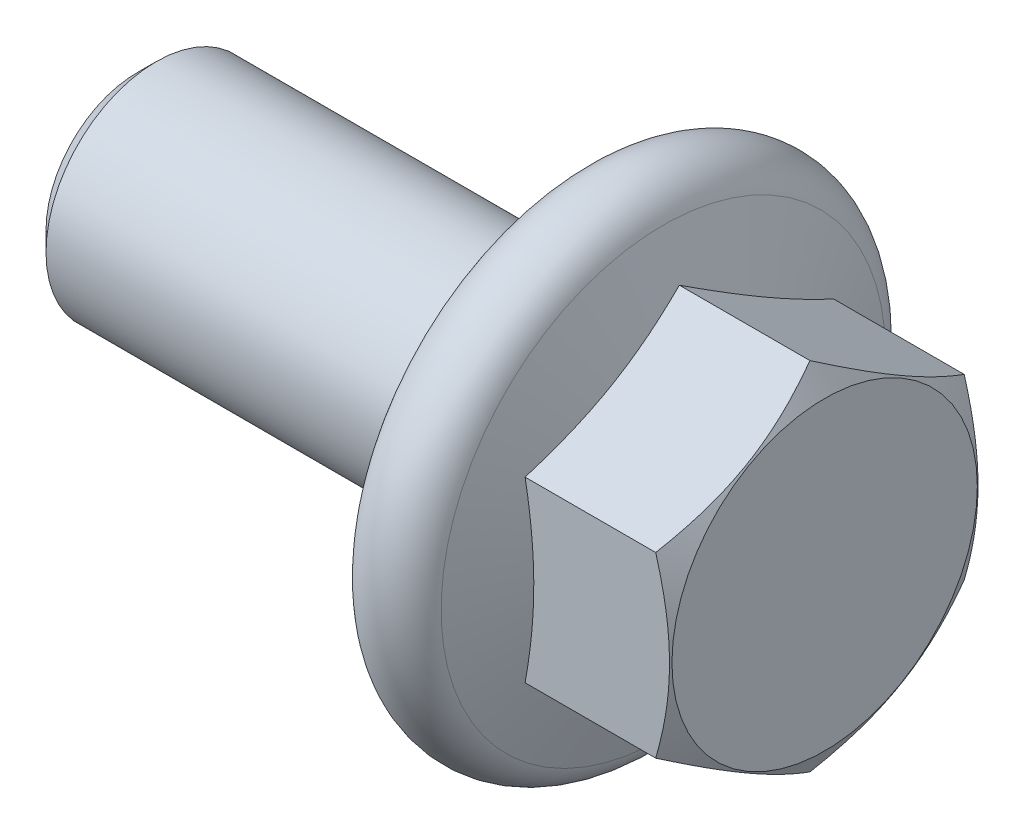
ISO-10303-21;
HEADER;
FILE_DESCRIPTION(('STEP AP214'),'2;1');
FILE_NAME('part.step','',(''),(''),'','','');
FILE_SCHEMA(('AUTOMOTIVE_DESIGN { 1 0 10303 214 1 1 1 1 }'));
ENDSEC;
DATA;
#1=APPLICATION_CONTEXT('core data for automotive mechanical design processes');
#2=APPLICATION_PROTOCOL_DEFINITION('international standard','automotive_design',2000,#1);
#3=PRODUCT_CONTEXT('',#1,'mechanical');
#4=PRODUCT('Part','Part','',(#3));
#5=PRODUCT_RELATED_PRODUCT_CATEGORY('part','',(#4));
#6=PRODUCT_DEFINITION_FORMATION('','',#4);
#7=PRODUCT_DEFINITION_CONTEXT('part definition',#1,'design');
#8=PRODUCT_DEFINITION('design','',#6,#7);
#9=PRODUCT_DEFINITION_SHAPE('','',#8);
#10=(LENGTH_UNIT() NAMED_UNIT(*) SI_UNIT(.MILLI.,.METRE.));
#11=(NAMED_UNIT(*) PLANE_ANGLE_UNIT() SI_UNIT($,.RADIAN.));
#12=(NAMED_UNIT(*) SI_UNIT($,.STERADIAN.) SOLID_ANGLE_UNIT());
#13=UNCERTAINTY_MEASURE_WITH_UNIT(LENGTH_MEASURE(1.E-05),#10,'distance_accuracy_value','');
#14=(GEOMETRIC_REPRESENTATION_CONTEXT(3) GLOBAL_UNCERTAINTY_ASSIGNED_CONTEXT((#13)) GLOBAL_UNIT_ASSIGNED_CONTEXT((#10,
#11,#12)) REPRESENTATION_CONTEXT('',''));
#15=CARTESIAN_POINT('',(0.,0.,0.));
#16=DIRECTION('',(0.,0.,1.));
#17=DIRECTION('',(1.,0.,0.));
#18=AXIS2_PLACEMENT_3D('',#15,#16,#17);
#19=CARTESIAN_POINT('',(286.686841982649,231.732577863432,-14.7960363538926));
#20=DIRECTION('',(0.,-0.866025403784439,0.5));
#21=DIRECTION('',(0.,0.5,0.866025403784439));
#22=AXIS2_PLACEMENT_3D('',#19,#20,#21);
#23=PLANE('',#22);
#24=CARTESIAN_POINT('',(285.690711667062,230.72221489235,-16.5460363538926));
#25=CARTESIAN_POINT('',(285.721179702552,230.805897608908,-16.4010936370985));
#26=CARTESIAN_POINT('',(285.748895550176,230.889856257758,-16.2556729915566));
#27=CARTESIAN_POINT('',(285.797657168736,231.058319411505,-15.9638862500622));
#28=CARTESIAN_POINT('',(285.818697721353,231.142824291017,-15.8175195052611));
#29=CARTESIAN_POINT('',(285.852730166642,231.311442187896,-15.5254647408003));
#30=CARTESIAN_POINT('',(285.865796282362,231.395551355216,-15.3797833896193));
#31=CARTESIAN_POINT('',(285.883321603825,231.563966359906,-15.0880800447394));
#32=CARTESIAN_POINT('',(285.887784036244,231.648272111669,-14.942058199316));
#33=CARTESIAN_POINT('',(285.887784036244,231.816883615195,-14.6500145084692));
#34=CARTESIAN_POINT('',(285.883321603825,231.901189366958,-14.5039926630458));
#35=CARTESIAN_POINT('',(285.865796282362,232.069604371647,-14.2122893181658));
#36=CARTESIAN_POINT('',(285.852730166642,232.153713538968,-14.0666079669849));
#37=CARTESIAN_POINT('',(285.818697721353,232.322331435847,-13.774553202524));
#38=CARTESIAN_POINT('',(285.797657168736,232.406836315359,-13.628186457723));
#39=CARTESIAN_POINT('',(285.748895550176,232.575299469106,-13.3363997162286));
#40=CARTESIAN_POINT('',(285.721179702552,232.659258117956,-13.1909790706867));
#41=CARTESIAN_POINT('',(285.690711667062,232.742940834514,-13.0460363538926));
#42=B_SPLINE_CURVE_WITH_KNOTS('',3,(#24,#25,#26,#27,#28,#29,#30,#31,#32,#33,#34,#35,#36,#37,#38,
#39,#40,#41),.UNSPECIFIED.,.F.,.F.,(4,2,2,2,2,2,2,2,4),(0.,0.510400948319181,1.02119991788174,
1.52716902069209,2.03294833077724,2.5387276408624,3.04469674367276,3.55549571323534,
4.06589666155451),.UNSPECIFIED.);
#43=CARTESIAN_POINT('',(285.690711667062,230.72221489235,-16.5460363538926));
#44=VERTEX_POINT('',#43);
#45=CARTESIAN_POINT('',(285.690711667062,232.742940834514,-13.0460363538926));
#46=VERTEX_POINT('',#45);
#47=EDGE_CURVE('E41',#44,#46,#42,.T.);
#48=ORIENTED_EDGE('',*,*,#47,.F.);
#49=DIRECTION('',(1.,0.,0.));
#50=VECTOR('',#49,1.);
#51=CARTESIAN_POINT('',(284.386841982649,230.72221489235,-16.5460363538926));
#52=LINE('',#51,#50);
#53=CARTESIAN_POINT('',(288.654027332057,230.72221489235,-16.5460363538925));
#54=VERTEX_POINT('',#53);
#55=EDGE_CURVE('E11',#44,#54,#52,.T.);
#56=ORIENTED_EDGE('',*,*,#55,.T.);
#57=CARTESIAN_POINT('',(288.654027332057,230.72221489235,-16.5460363538925));
#58=CARTESIAN_POINT('',(288.705310128086,230.81101355955,-16.3922325506572));
#59=CARTESIAN_POINT('',(288.751949147132,230.900578735583,-16.2371011151804));
#60=CARTESIAN_POINT('',(288.833356154107,231.081259848759,-15.9241522471918));
#61=CARTESIAN_POINT('',(288.868095346466,231.172378995211,-15.7663292559944));
#62=CARTESIAN_POINT('',(288.922169403902,231.35348809421,-15.4526390948144));
#63=CARTESIAN_POINT('',(288.941864203763,231.443450188607,-15.2968201765637));
#64=CARTESIAN_POINT('',(288.965371287829,231.623797457934,-14.9844495430839));
#65=CARTESIAN_POINT('',(288.969203042603,231.7141819778,-14.8278989624581));
#66=CARTESIAN_POINT('',(288.961211324287,231.883055756952,-14.5354009969003));
#67=CARTESIAN_POINT('',(288.951350082929,231.961570357124,-14.3994097202657));
#68=CARTESIAN_POINT('',(288.920102055801,232.11808806046,-14.1283131058041));
#69=CARTESIAN_POINT('',(288.898704606212,232.196090622674,-13.9932087049282));
#70=CARTESIAN_POINT('',(288.845215123715,232.35293076724,-13.7215536058745));
#71=CARTESIAN_POINT('',(288.812896458175,232.431748509368,-13.5850372719713));
#72=CARTESIAN_POINT('',(288.739546750589,232.588208767002,-13.3140401563839));
#73=CARTESIAN_POINT('',(288.698532931741,232.665853285398,-13.1795559055918));
#74=CARTESIAN_POINT('',(288.654027332057,232.742940834514,-13.0460363538926));
#75=B_SPLINE_CURVE_WITH_KNOTS('',3,(#57,#58,#59,#60,#61,#62,#63,#64,#65,#66,#67,#68,#69,#70,#71,
#72,#73,#74),.UNSPECIFIED.,.F.,.F.,(4,2,2,2,2,2,2,2,4),(0.,0.554778020224597,1.11088917979761,
1.65323831076784,2.1949215555715,2.66648861960608,3.13849233914043,3.62096283935531,
4.10248645365123),.UNSPECIFIED.);
#76=CARTESIAN_POINT('',(288.654027332057,232.742940834514,-13.0460363538926));
#77=VERTEX_POINT('',#76);
#78=EDGE_CURVE('E33',#54,#77,#75,.T.);
#79=ORIENTED_EDGE('',*,*,#78,.T.);
#80=DIRECTION('',(1.,0.,0.));
#81=VECTOR('',#80,1.);
#82=CARTESIAN_POINT('',(284.386841982649,232.742940834514,-13.0460363538926));
#83=LINE('',#82,#81);
#84=EDGE_CURVE('E148',#46,#77,#83,.T.);
#85=ORIENTED_EDGE('',*,*,#84,.F.);
#86=EDGE_LOOP('',(#48,#56,#79,#85));
#87=FACE_BOUND('',#86,.T.);
#88=ADVANCED_FACE('F17',(#87),#23,.T.);
#89=CARTESIAN_POINT('',(286.686841982649,234.763666776678,-13.0460363538926));
#90=DIRECTION('',(0.,0.,1.));
#91=DIRECTION('',(0.,1.,0.));
#92=AXIS2_PLACEMENT_3D('',#89,#90,#91);
#93=PLANE('',#92);
#94=CARTESIAN_POINT('',(285.690711667062,232.742940834514,-13.0460363538926));
#95=CARTESIAN_POINT('',(285.721179702552,232.91030626763,-13.0460363538926));
#96=CARTESIAN_POINT('',(285.748895550176,233.078223565329,-13.0460363538926));
#97=CARTESIAN_POINT('',(285.797657168736,233.415149872825,-13.0460363538926));
#98=CARTESIAN_POINT('',(285.818697721354,233.584159631847,-13.0460363538926));
#99=CARTESIAN_POINT('',(285.852730166642,233.921395425607,-13.0460363538926));
#100=CARTESIAN_POINT('',(285.865796282362,234.089613760247,-13.0460363538926));
#101=CARTESIAN_POINT('',(285.883321603825,234.426443769627,-13.0460363538926));
#102=CARTESIAN_POINT('',(285.887784036244,234.595055273152,-13.0460363538926));
#103=CARTESIAN_POINT('',(285.887784036244,234.932278280204,-13.0460363538926));
#104=CARTESIAN_POINT('',(285.883321603825,235.100889783729,-13.0460363538926));
#105=CARTESIAN_POINT('',(285.865796282362,235.437719793109,-13.0460363538926));
#106=CARTESIAN_POINT('',(285.852730166642,235.605938127749,-13.0460363538926));
#107=CARTESIAN_POINT('',(285.818697721354,235.943173921509,-13.0460363538926));
#108=CARTESIAN_POINT('',(285.797657168736,236.112183680531,-13.0460363538926));
#109=CARTESIAN_POINT('',(285.748895550176,236.449109988027,-13.0460363538926));
#110=CARTESIAN_POINT('',(285.721179702552,236.617027285726,-13.0460363538926));
#111=CARTESIAN_POINT('',(285.690711667062,236.784392718842,-13.0460363538926));
#112=B_SPLINE_CURVE_WITH_KNOTS('',3,(#94,#95,#96,#97,#98,#99,#100,#101,#102,#103,#104,#105,#106,
#107,#108,#109,#110,#111),.UNSPECIFIED.,.F.,.F.,(4,2,2,2,2,2,2,2,4),(0.,0.510400948319247,
1.02119991788187,1.52716902069227,2.03294833077751,2.53872764086272,3.04469674367309,
3.55549571323574,4.06589666155499),.UNSPECIFIED.);
#113=CARTESIAN_POINT('',(285.690711667062,236.784392718842,-13.0460363538926));
#114=VERTEX_POINT('',#113);
#115=EDGE_CURVE('E255',#46,#114,#112,.T.);
#116=ORIENTED_EDGE('',*,*,#115,.F.);
#117=ORIENTED_EDGE('',*,*,#84,.T.);
#118=CARTESIAN_POINT('',(288.654027332057,232.742940834514,-13.0460363538926));
#119=CARTESIAN_POINT('',(288.705310128086,232.920538168915,-13.0460363538926));
#120=CARTESIAN_POINT('',(288.751949147132,233.099668520979,-13.0460363538926));
#121=CARTESIAN_POINT('',(288.833356154107,233.461030747331,-13.0460363538926));
#122=CARTESIAN_POINT('',(288.868095346466,233.643269040235,-13.0460363538926));
#123=CARTESIAN_POINT('',(288.922169403902,234.005487238234,-13.0460363538926));
#124=CARTESIAN_POINT('',(288.941864203763,234.185411427028,-13.0460363538926));
#125=CARTESIAN_POINT('',(288.965371287829,234.546105965681,-13.0460363538926));
#126=CARTESIAN_POINT('',(288.969203042603,234.726875005413,-13.0460363538926));
#127=CARTESIAN_POINT('',(288.961211324287,235.064622563717,-13.0460363538926));
#128=CARTESIAN_POINT('',(288.951350082929,235.221651764062,-13.0460363538926));
#129=CARTESIAN_POINT('',(288.920102055801,235.534687170734,-13.0460363538926));
#130=CARTESIAN_POINT('',(288.898704606212,235.690692295163,-13.0460363538926));
#131=CARTESIAN_POINT('',(288.845215123716,236.004372584294,-13.0460363538926));
#132=CARTESIAN_POINT('',(288.812896458176,236.162008068549,-13.0460363538926));
#133=CARTESIAN_POINT('',(288.739546750589,236.474928583817,-13.0460363538926));
#134=CARTESIAN_POINT('',(288.698532931741,236.630217620611,-13.0460363538926));
#135=CARTESIAN_POINT('',(288.654027332057,236.784392718842,-13.0460363538926));
#136=B_SPLINE_CURVE_WITH_KNOTS('',3,(#118,#119,#120,#121,#122,#123,#124,#125,#126,#127,#128,
#129,#130,#131,#132,#133,#134,#135),.UNSPECIFIED.,.F.,.F.,(4,2,2,2,2,2,2,2,4),(0.,
0.554778020224548,1.11088917979758,1.65323831076777,2.19492155557137,2.66648861960611,
3.13849233914063,3.62096283935574,4.10248645365189),.UNSPECIFIED.);
#137=CARTESIAN_POINT('',(288.654027332057,236.784392718842,-13.0460363538926));
#138=VERTEX_POINT('',#137);
#139=EDGE_CURVE('E150',#77,#138,#136,.T.);
#140=ORIENTED_EDGE('',*,*,#139,.T.);
#141=DIRECTION('',(1.,0.,0.));
#142=VECTOR('',#141,1.);
#143=CARTESIAN_POINT('',(284.386841982649,236.784392718842,-13.0460363538926));
#144=LINE('',#143,#142);
#145=EDGE_CURVE('E159',#114,#138,#144,.T.);
#146=ORIENTED_EDGE('',*,*,#145,.F.);
#147=EDGE_LOOP('',(#116,#117,#140,#146));
#148=FACE_BOUND('',#147,.T.);
#149=ADVANCED_FACE('F260',(#148),#93,.T.);
#150=CARTESIAN_POINT('',(286.686841982649,237.794755689923,-14.7960363538926));
#151=DIRECTION('',(0.,0.866025403784439,0.5));
#152=DIRECTION('',(0.,0.5,-0.866025403784439));
#153=AXIS2_PLACEMENT_3D('',#150,#151,#152);
#154=PLANE('',#153);
#155=CARTESIAN_POINT('',(285.690711667062,236.784392718842,-13.046036353893));
#156=CARTESIAN_POINT('',(285.721179702552,236.8680754354,-13.1909790706871));
#157=CARTESIAN_POINT('',(285.748895550176,236.952034084249,-13.336399716229));
#158=CARTESIAN_POINT('',(285.797657168736,237.120497237997,-13.6281864577234));
#159=CARTESIAN_POINT('',(285.818697721354,237.205002117508,-13.7745532025244));
#160=CARTESIAN_POINT('',(285.852730166643,237.373620014388,-14.0666079669853));
#161=CARTESIAN_POINT('',(285.865796282363,237.457729181708,-14.2122893181662));
#162=CARTESIAN_POINT('',(285.883321603825,237.626144186398,-14.5039926630461));
#163=CARTESIAN_POINT('',(285.887784036245,237.71044993816,-14.6500145084695));
#164=CARTESIAN_POINT('',(285.887784036245,237.879061441686,-14.9420581993163));
#165=CARTESIAN_POINT('',(285.883321603825,237.963367193449,-15.0880800447396));
#166=CARTESIAN_POINT('',(285.865796282363,238.131782198139,-15.3797833896196));
#167=CARTESIAN_POINT('',(285.852730166643,238.215891365459,-15.5254647408005));
#168=CARTESIAN_POINT('',(285.818697721354,238.384509262338,-15.8175195052613));
#169=CARTESIAN_POINT('',(285.797657168736,238.46901414185,-15.9638862500624));
#170=CARTESIAN_POINT('',(285.748895550176,238.637477295597,-16.2556729915567));
#171=CARTESIAN_POINT('',(285.721179702552,238.721435944447,-16.4010936370986));
#172=CARTESIAN_POINT('',(285.690711667062,238.805118661005,-16.5460363538927));
#173=B_SPLINE_CURVE_WITH_KNOTS('',3,(#155,#156,#157,#158,#159,#160,#161,#162,#163,#164,#165,
#166,#167,#168,#169,#170,#171,#172),.UNSPECIFIED.,.F.,.F.,(4,2,2,2,2,2,2,2,4),(0.,
0.510400948319119,1.02119991788166,1.52716902069197,2.03294833077706,2.53872764086216,
3.04469674367245,3.555495713235,4.06589666155412),.UNSPECIFIED.);
#174=CARTESIAN_POINT('',(285.690711667062,238.805118661005,-16.5460363538927));
#175=VERTEX_POINT('',#174);
#176=EDGE_CURVE('E228',#114,#175,#173,.T.);
#177=ORIENTED_EDGE('',*,*,#176,.F.);
#178=ORIENTED_EDGE('',*,*,#145,.T.);
#179=CARTESIAN_POINT('',(288.654027332058,236.784392718842,-13.046036353893));
#180=CARTESIAN_POINT('',(288.705310128086,236.873191386042,-13.1998401571283));
#181=CARTESIAN_POINT('',(288.751949147133,236.962756562074,-13.3549715926051));
#182=CARTESIAN_POINT('',(288.833356154107,237.14343767525,-13.6679204605936));
#183=CARTESIAN_POINT('',(288.868095346466,237.234556821702,-13.825743451791));
#184=CARTESIAN_POINT('',(288.922169403902,237.415665920701,-14.1394336129709));
#185=CARTESIAN_POINT('',(288.941864203763,237.505628015098,-14.2952525312216));
#186=CARTESIAN_POINT('',(288.96537128783,237.685975284425,-14.6076231647013));
#187=CARTESIAN_POINT('',(288.969203042603,237.776359804291,-14.764173745327));
#188=CARTESIAN_POINT('',(288.961211324287,237.945233583443,-15.0566717108848));
#189=CARTESIAN_POINT('',(288.951350082929,238.023748183615,-15.1926629875194));
#190=CARTESIAN_POINT('',(288.920102055801,238.180265886951,-15.463759601981));
#191=CARTESIAN_POINT('',(288.898704606213,238.258268449165,-15.5988640028569));
#192=CARTESIAN_POINT('',(288.845215123716,238.415108593731,-15.8705191019107));
#193=CARTESIAN_POINT('',(288.812896458176,238.493926335859,-16.0070354358139));
#194=CARTESIAN_POINT('',(288.739546750589,238.650386593493,-16.2780325514013));
#195=CARTESIAN_POINT('',(288.698532931742,238.728031111889,-16.4125168021935));
#196=CARTESIAN_POINT('',(288.654027332058,238.805118661005,-16.5460363538927));
#197=B_SPLINE_CURVE_WITH_KNOTS('',3,(#179,#180,#181,#182,#183,#184,#185,#186,#187,#188,#189,
#190,#191,#192,#193,#194,#195,#196),.UNSPECIFIED.,.F.,.F.,(4,2,2,2,2,2,2,2,4),(0.,
0.554778020224428,1.11088917979728,1.65323831076738,2.19492155557089,2.6664886196055,
3.13849233913986,3.62096283935479,4.10248645365079),.UNSPECIFIED.);
#198=CARTESIAN_POINT('',(288.654027332058,238.805118661005,-16.5460363538927));
#199=VERTEX_POINT('',#198);
#200=EDGE_CURVE('E158',#138,#199,#197,.T.);
#201=ORIENTED_EDGE('',*,*,#200,.T.);
#202=DIRECTION('',(1.,0.,0.));
#203=VECTOR('',#202,1.);
#204=CARTESIAN_POINT('',(284.386841982649,238.805118661005,-16.5460363538926));
#205=LINE('',#204,#203);
#206=EDGE_CURVE('E156',#175,#199,#205,.T.);
#207=ORIENTED_EDGE('',*,*,#206,.F.);
#208=EDGE_LOOP('',(#177,#178,#201,#207));
#209=FACE_BOUND('',#208,.T.);
#210=ADVANCED_FACE('F219',(#209),#154,.T.);
#211=CARTESIAN_POINT('',(286.686841982649,237.794755689923,-18.2960363538926));
#212=DIRECTION('',(0.,0.866025403784439,-0.5));
#213=DIRECTION('',(0.,-0.5,-0.866025403784439));
#214=AXIS2_PLACEMENT_3D('',#211,#212,#213);
#215=PLANE('',#214);
#216=CARTESIAN_POINT('',(285.690711667062,238.805118661005,-16.5460363538925));
#217=CARTESIAN_POINT('',(285.721179702552,238.721435944447,-16.6909790706866));
#218=CARTESIAN_POINT('',(285.748895550176,238.637477295597,-16.8363997162285));
#219=CARTESIAN_POINT('',(285.797657168736,238.46901414185,-17.1281864577228));
#220=CARTESIAN_POINT('',(285.818697721354,238.384509262338,-17.2745532025239));
#221=CARTESIAN_POINT('',(285.852730166643,238.215891365459,-17.5666079669847));
#222=CARTESIAN_POINT('',(285.865796282363,238.131782198139,-17.7122893181656));
#223=CARTESIAN_POINT('',(285.883321603825,237.963367193449,-18.0039926630456));
#224=CARTESIAN_POINT('',(285.887784036245,237.879061441686,-18.1500145084689));
#225=CARTESIAN_POINT('',(285.887784036245,237.71044993816,-18.4420581993157));
#226=CARTESIAN_POINT('',(285.883321603825,237.626144186398,-18.5880800447391));
#227=CARTESIAN_POINT('',(285.865796282363,237.457729181708,-18.879783389619));
#228=CARTESIAN_POINT('',(285.852730166643,237.373620014388,-19.0254647407999));
#229=CARTESIAN_POINT('',(285.818697721354,237.205002117508,-19.3175195052608));
#230=CARTESIAN_POINT('',(285.797657168736,237.120497237997,-19.4638862500618));
#231=CARTESIAN_POINT('',(285.748895550176,236.952034084249,-19.7556729915562));
#232=CARTESIAN_POINT('',(285.721179702552,236.8680754354,-19.9010936370981));
#233=CARTESIAN_POINT('',(285.690711667062,236.784392718842,-20.0460363538923));
#234=B_SPLINE_CURVE_WITH_KNOTS('',3,(#216,#217,#218,#219,#220,#221,#222,#223,#224,#225,#226,
#227,#228,#229,#230,#231,#232,#233),.UNSPECIFIED.,.F.,.F.,(4,2,2,2,2,2,2,2,4),(0.,
0.51040094831914,1.02119991788167,1.52716902069196,2.03294833077706,2.53872764086216,
3.04469674367247,3.555495713235,4.06589666155413),.UNSPECIFIED.);
#235=CARTESIAN_POINT('',(285.690711667062,236.784392718842,-20.0460363538924));
#236=VERTEX_POINT('',#235);
#237=EDGE_CURVE('E64',#175,#236,#234,.T.);
#238=ORIENTED_EDGE('',*,*,#237,.F.);
#239=ORIENTED_EDGE('',*,*,#206,.T.);
#240=CARTESIAN_POINT('',(288.654027332058,238.805118661005,-16.5460363538925));
#241=CARTESIAN_POINT('',(288.705310128086,238.716319993805,-16.6998401571278));
#242=CARTESIAN_POINT('',(288.751949147133,238.626754817772,-16.8549715926046));
#243=CARTESIAN_POINT('',(288.833356154107,238.446073704597,-17.1679204605931));
#244=CARTESIAN_POINT('',(288.868095346466,238.354954558144,-17.3257434517905));
#245=CARTESIAN_POINT('',(288.922169403902,238.173845459145,-17.6394336129704));
#246=CARTESIAN_POINT('',(288.941864203763,238.083883364748,-17.795252531221));
#247=CARTESIAN_POINT('',(288.96537128783,237.903536095422,-18.1076231647008));
#248=CARTESIAN_POINT('',(288.969203042603,237.813151575556,-18.2641737453266));
#249=CARTESIAN_POINT('',(288.961211324287,237.644277796404,-18.5566717108843));
#250=CARTESIAN_POINT('',(288.951350082929,237.565763196231,-18.6926629875189));
#251=CARTESIAN_POINT('',(288.920102055801,237.409245492895,-18.9637596019804));
#252=CARTESIAN_POINT('',(288.898704606213,237.331242930681,-19.0988640028564));
#253=CARTESIAN_POINT('',(288.845215123716,237.174402786115,-19.3705191019101));
#254=CARTESIAN_POINT('',(288.812896458176,237.095585043988,-19.5070354358134));
#255=CARTESIAN_POINT('',(288.739546750589,236.939124786354,-19.7780325514007));
#256=CARTESIAN_POINT('',(288.698532931742,236.861480267957,-19.9125168021929));
#257=CARTESIAN_POINT('',(288.654027332058,236.784392718842,-20.0460363538922));
#258=B_SPLINE_CURVE_WITH_KNOTS('',3,(#240,#241,#242,#243,#244,#245,#246,#247,#248,#249,#250,
#251,#252,#253,#254,#255,#256,#257),.UNSPECIFIED.,.F.,.F.,(4,2,2,2,2,2,2,2,4),(0.,
0.554778020224401,1.11088917979728,1.65323831076737,2.19492155557089,2.6664886196055,
3.13849233913987,3.6209628393548,4.10248645365077),.UNSPECIFIED.);
#259=CARTESIAN_POINT('',(288.654027332058,236.784392718842,-20.0460363538924));
#260=VERTEX_POINT('',#259);
#261=EDGE_CURVE('E155',#199,#260,#258,.T.);
#262=ORIENTED_EDGE('',*,*,#261,.T.);
#263=DIRECTION('',(1.,0.,0.));
#264=VECTOR('',#263,1.);
#265=CARTESIAN_POINT('',(284.386841982649,236.784392718842,-20.0460363538926));
#266=LINE('',#265,#264);
#267=EDGE_CURVE('E153',#236,#260,#266,.T.);
#268=ORIENTED_EDGE('',*,*,#267,.F.);
#269=EDGE_LOOP('',(#238,#239,#262,#268));
#270=FACE_BOUND('',#269,.T.);
#271=ADVANCED_FACE('F214',(#270),#215,.T.);
#272=CARTESIAN_POINT('',(286.686841982649,234.763666776678,-20.0460363538926));
#273=DIRECTION('',(0.,0.,-1.));
#274=DIRECTION('',(0.,-1.,0.));
#275=AXIS2_PLACEMENT_3D('',#272,#273,#274);
#276=PLANE('',#275);
#277=CARTESIAN_POINT('',(285.690711667062,236.784392718842,-20.0460363538926));
#278=CARTESIAN_POINT('',(285.721179702552,236.617027285726,-20.0460363538926));
#279=CARTESIAN_POINT('',(285.748895550176,236.449109988027,-20.0460363538926));
#280=CARTESIAN_POINT('',(285.797657168736,236.112183680531,-20.0460363538926));
#281=CARTESIAN_POINT('',(285.818697721354,235.943173921509,-20.0460363538926));
#282=CARTESIAN_POINT('',(285.852730166642,235.605938127749,-20.0460363538926));
#283=CARTESIAN_POINT('',(285.865796282362,235.437719793109,-20.0460363538926));
#284=CARTESIAN_POINT('',(285.883321603825,235.100889783729,-20.0460363538926));
#285=CARTESIAN_POINT('',(285.887784036244,234.932278280204,-20.0460363538926));
#286=CARTESIAN_POINT('',(285.887784036244,234.595055273152,-20.0460363538926));
#287=CARTESIAN_POINT('',(285.883321603825,234.426443769627,-20.0460363538926));
#288=CARTESIAN_POINT('',(285.865796282362,234.089613760247,-20.0460363538926));
#289=CARTESIAN_POINT('',(285.852730166642,233.921395425607,-20.0460363538926));
#290=CARTESIAN_POINT('',(285.818697721354,233.584159631847,-20.0460363538926));
#291=CARTESIAN_POINT('',(285.797657168736,233.415149872825,-20.0460363538926));
#292=CARTESIAN_POINT('',(285.748895550176,233.078223565329,-20.0460363538926));
#293=CARTESIAN_POINT('',(285.721179702552,232.91030626763,-20.0460363538926));
#294=CARTESIAN_POINT('',(285.690711667062,232.742940834514,-20.0460363538926));
#295=B_SPLINE_CURVE_WITH_KNOTS('',3,(#277,#278,#279,#280,#281,#282,#283,#284,#285,#286,#287,
#288,#289,#290,#291,#292,#293,#294),.UNSPECIFIED.,.F.,.F.,(4,2,2,2,2,2,2,2,4),(0.,
0.510400948319247,1.0211999178819,1.52716902069227,2.03294833077748,2.53872764086272,
3.04469674367312,3.55549571323574,4.06589666155499),.UNSPECIFIED.);
#296=CARTESIAN_POINT('',(285.690711667062,232.742940834514,-20.0460363538926));
#297=VERTEX_POINT('',#296);
#298=EDGE_CURVE('E21',#236,#297,#295,.T.);
#299=ORIENTED_EDGE('',*,*,#298,.F.);
#300=ORIENTED_EDGE('',*,*,#267,.T.);
#301=CARTESIAN_POINT('',(288.654027332057,236.784392718842,-20.0460363538926));
#302=CARTESIAN_POINT('',(288.705310128086,236.606795384441,-20.0460363538926));
#303=CARTESIAN_POINT('',(288.751949147132,236.427665032377,-20.0460363538926));
#304=CARTESIAN_POINT('',(288.833356154107,236.066302806025,-20.0460363538926));
#305=CARTESIAN_POINT('',(288.868095346466,235.884064513121,-20.0460363538926));
#306=CARTESIAN_POINT('',(288.922169403902,235.521846315122,-20.0460363538926));
#307=CARTESIAN_POINT('',(288.941864203763,235.341922126328,-20.0460363538926));
#308=CARTESIAN_POINT('',(288.965371287829,234.981227587675,-20.0460363538926));
#309=CARTESIAN_POINT('',(288.969203042603,234.800458547943,-20.0460363538926));
#310=CARTESIAN_POINT('',(288.961211324287,234.462710989639,-20.0460363538926));
#311=CARTESIAN_POINT('',(288.951350082929,234.305681789294,-20.0460363538926));
#312=CARTESIAN_POINT('',(288.920102055801,233.992646382622,-20.0460363538926));
#313=CARTESIAN_POINT('',(288.898704606212,233.836641258193,-20.0460363538926));
#314=CARTESIAN_POINT('',(288.845215123716,233.522960969062,-20.0460363538926));
#315=CARTESIAN_POINT('',(288.812896458176,233.365325484807,-20.0460363538926));
#316=CARTESIAN_POINT('',(288.739546750589,233.052404969539,-20.0460363538926));
#317=CARTESIAN_POINT('',(288.698532931741,232.897115932745,-20.0460363538926));
#318=CARTESIAN_POINT('',(288.654027332057,232.742940834514,-20.0460363538926));
#319=B_SPLINE_CURVE_WITH_KNOTS('',3,(#301,#302,#303,#304,#305,#306,#307,#308,#309,#310,#311,
#312,#313,#314,#315,#316,#317,#318),.UNSPECIFIED.,.F.,.F.,(4,2,2,2,2,2,2,2,4),(0.,
0.554778020224548,1.11088917979761,1.65323831076782,2.19492155557142,2.66648861960614,
3.13849233914066,3.62096283935576,4.10248645365189),.UNSPECIFIED.);
#320=CARTESIAN_POINT('',(288.654027332057,232.742940834514,-20.0460363538926));
#321=VERTEX_POINT('',#320);
#322=EDGE_CURVE('E152',#260,#321,#319,.T.);
#323=ORIENTED_EDGE('',*,*,#322,.T.);
#324=DIRECTION('',(1.,0.,0.));
#325=VECTOR('',#324,1.);
#326=CARTESIAN_POINT('',(284.386841982649,232.742940834514,-20.0460363538926));
#327=LINE('',#326,#325);
#328=EDGE_CURVE('E73',#297,#321,#327,.T.);
#329=ORIENTED_EDGE('',*,*,#328,.F.);
#330=EDGE_LOOP('',(#299,#300,#323,#329));
#331=FACE_BOUND('',#330,.T.);
#332=ADVANCED_FACE('F211',(#331),#276,.T.);
#333=CARTESIAN_POINT('',(286.686841982649,231.732577863432,-18.2960363538926));
#334=DIRECTION('',(0.,-0.866025403784439,-0.5));
#335=DIRECTION('',(0.,-0.5,0.866025403784439));
#336=AXIS2_PLACEMENT_3D('',#333,#334,#335);
#337=PLANE('',#336);
#338=CARTESIAN_POINT('',(285.690711667062,232.742940834514,-20.0460363538926));
#339=CARTESIAN_POINT('',(285.721179702552,232.659258117956,-19.9010936370985));
#340=CARTESIAN_POINT('',(285.748895550176,232.575299469106,-19.7556729915566));
#341=CARTESIAN_POINT('',(285.797657168736,232.406836315359,-19.4638862500622));
#342=CARTESIAN_POINT('',(285.818697721353,232.322331435847,-19.3175195052612));
#343=CARTESIAN_POINT('',(285.852730166642,232.153713538968,-19.0254647408003));
#344=CARTESIAN_POINT('',(285.865796282362,232.069604371647,-18.8797833896194));
#345=CARTESIAN_POINT('',(285.883321603825,231.901189366958,-18.5880800447394));
#346=CARTESIAN_POINT('',(285.887784036244,231.816883615195,-18.442058199316));
#347=CARTESIAN_POINT('',(285.887784036244,231.648272111669,-18.1500145084692));
#348=CARTESIAN_POINT('',(285.883321603825,231.563966359906,-18.0039926630458));
#349=CARTESIAN_POINT('',(285.865796282362,231.395551355216,-17.7122893181658));
#350=CARTESIAN_POINT('',(285.852730166642,231.311442187896,-17.5666079669849));
#351=CARTESIAN_POINT('',(285.818697721353,231.142824291017,-17.274553202524));
#352=CARTESIAN_POINT('',(285.797657168736,231.058319411505,-17.128186457723));
#353=CARTESIAN_POINT('',(285.748895550176,230.889856257758,-16.8363997162286));
#354=CARTESIAN_POINT('',(285.721179702552,230.805897608908,-16.6909790706867));
#355=CARTESIAN_POINT('',(285.690711667062,230.72221489235,-16.5460363538925));
#356=B_SPLINE_CURVE_WITH_KNOTS('',3,(#338,#339,#340,#341,#342,#343,#344,#345,#346,#347,#348,
#349,#350,#351,#352,#353,#354,#355),.UNSPECIFIED.,.F.,.F.,(4,2,2,2,2,2,2,2,4),(0.,
0.510400948319185,1.02119991788176,1.52716902069212,2.03294833077728,2.53872764086243,
3.04469674367279,3.55549571323535,4.06589666155454),.UNSPECIFIED.);
#357=EDGE_CURVE('E121',#297,#44,#356,.T.);
#358=ORIENTED_EDGE('',*,*,#357,.F.);
#359=ORIENTED_EDGE('',*,*,#328,.T.);
#360=CARTESIAN_POINT('',(288.654027332057,232.742940834514,-20.0460363538925));
#361=CARTESIAN_POINT('',(288.705310128086,232.654142167314,-19.8922325506573));
#362=CARTESIAN_POINT('',(288.751949147132,232.564576991281,-19.7371011151805));
#363=CARTESIAN_POINT('',(288.833356154107,232.383895878105,-19.4241522471919));
#364=CARTESIAN_POINT('',(288.868095346466,232.292776731653,-19.2663292559945));
#365=CARTESIAN_POINT('',(288.922169403902,232.111667632654,-18.9526390948145));
#366=CARTESIAN_POINT('',(288.941864203763,232.021705538257,-18.7968201765637));
#367=CARTESIAN_POINT('',(288.965371287829,231.84135826893,-18.484449543084));
#368=CARTESIAN_POINT('',(288.969203042603,231.750973749064,-18.3278989624582));
#369=CARTESIAN_POINT('',(288.961211324287,231.582099969912,-18.0354009969004));
#370=CARTESIAN_POINT('',(288.951350082929,231.50358536974,-17.8994097202658));
#371=CARTESIAN_POINT('',(288.920102055801,231.347067666404,-17.6283131058042));
#372=CARTESIAN_POINT('',(288.898704606212,231.26906510419,-17.4932087049283));
#373=CARTESIAN_POINT('',(288.845215123715,231.112224959624,-17.2215536058746));
#374=CARTESIAN_POINT('',(288.812896458175,231.033407217496,-17.0850372719713));
#375=CARTESIAN_POINT('',(288.739546750589,230.876946959862,-16.814040156384));
#376=CARTESIAN_POINT('',(288.698532931741,230.799302441466,-16.6795559055918));
#377=CARTESIAN_POINT('',(288.654027332057,230.72221489235,-16.5460363538927));
#378=B_SPLINE_CURVE_WITH_KNOTS('',3,(#360,#361,#362,#363,#364,#365,#366,#367,#368,#369,#370,
#371,#372,#373,#374,#375,#376,#377),.UNSPECIFIED.,.F.,.F.,(4,2,2,2,2,2,2,2,4),(0.,
0.554778020224549,1.11088917979756,1.65323831076781,2.19492155557145,2.66648861960601,
3.13849233914037,3.62096283935529,4.10248645365123),.UNSPECIFIED.);
#379=EDGE_CURVE('E116',#321,#54,#378,.T.);
#380=ORIENTED_EDGE('',*,*,#379,.T.);
#381=ORIENTED_EDGE('',*,*,#55,.F.);
#382=EDGE_LOOP('',(#358,#359,#380,#381));
#383=FACE_BOUND('',#382,.T.);
#384=ADVANCED_FACE('F181',(#383),#337,.T.);
#385=CARTESIAN_POINT('',(290.987360665391,234.763666776678,-16.5460363538926));
#386=DIRECTION('',(-1.,0.,0.));
#387=DIRECTION('',(0.,0.,-1.));
#388=AXIS2_PLACEMENT_3D('',#385,#386,#387);
#389=CONICAL_SURFACE('',#388,0.,1.0471975511966);
#390=ORIENTED_EDGE('',*,*,#78,.F.);
#391=ORIENTED_EDGE('',*,*,#379,.F.);
#392=ORIENTED_EDGE('',*,*,#322,.F.);
#393=ORIENTED_EDGE('',*,*,#261,.F.);
#394=ORIENTED_EDGE('',*,*,#200,.F.);
#395=ORIENTED_EDGE('',*,*,#139,.F.);
#396=EDGE_LOOP('',(#390,#391,#392,#393,#394,#395));
#397=FACE_BOUND('',#396,.T.);
#398=CARTESIAN_POINT('',(288.986841982649,234.763666776678,-16.5460363538926));
#399=DIRECTION('',(1.,0.,0.));
#400=DIRECTION('',(0.,0.,-1.));
#401=AXIS2_PLACEMENT_3D('',#398,#399,#400);
#402=CIRCLE('',#401,3.465);
#403=CARTESIAN_POINT('',(288.986841982649,234.763666776678,-20.0110363538926));
#404=VERTEX_POINT('',#403);
#405=EDGE_CURVE('E113',#404,#404,#402,.T.);
#406=ORIENTED_EDGE('',*,*,#405,.F.);
#407=EDGE_LOOP('',(#406));
#408=FACE_BOUND('',#407,.T.);
#409=ADVANCED_FACE('F114',(#397,#408),#389,.T.);
#410=CARTESIAN_POINT('',(288.986841982649,234.763666776678,-16.5460363538926));
#411=DIRECTION('',(1.,0.,0.));
#412=DIRECTION('',(0.,0.,1.));
#413=AXIS2_PLACEMENT_3D('',#410,#411,#412);
#414=PLANE('',#413);
#415=ORIENTED_EDGE('',*,*,#405,.T.);
#416=EDGE_LOOP('',(#415));
#417=FACE_BOUND('',#416,.T.);
#418=ADVANCED_FACE('F180',(#417),#414,.T.);
#419=CARTESIAN_POINT('',(283.386841982649,234.763666776678,-16.5460363538926));
#420=DIRECTION('',(-1.,0.,0.));
#421=DIRECTION('',(0.,0.,-1.));
#422=AXIS2_PLACEMENT_3D('',#419,#420,#421);
#423=PLANE('',#422);
#424=CARTESIAN_POINT('',(283.386841982649,234.763666776678,-16.5460363538926));
#425=DIRECTION('',(-1.,0.,0.));
#426=DIRECTION('',(0.,0.,1.));
#427=AXIS2_PLACEMENT_3D('',#424,#425,#426);
#428=CIRCLE('',#427,3.05551918177834);
#429=CARTESIAN_POINT('',(283.386841982649,234.763666776678,-13.4905171721143));
#430=VERTEX_POINT('',#429);
#431=EDGE_CURVE('E124',#430,#430,#428,.T.);
#432=ORIENTED_EDGE('',*,*,#431,.F.);
#433=EDGE_LOOP('',(#432));
#434=FACE_BOUND('',#433,.T.);
#435=CARTESIAN_POINT('',(283.386841982649,234.763666776678,-16.5460363538926));
#436=DIRECTION('',(-1.,0.,0.));
#437=DIRECTION('',(0.,0.,1.));
#438=AXIS2_PLACEMENT_3D('',#435,#436,#437);
#439=CIRCLE('',#438,4.7);
#440=CARTESIAN_POINT('',(283.386841982649,234.763666776678,-11.8460363538926));
#441=VERTEX_POINT('',#440);
#442=EDGE_CURVE('E117',#441,#441,#439,.T.);
#443=ORIENTED_EDGE('',*,*,#442,.T.);
#444=EDGE_LOOP('',(#443));
#445=FACE_BOUND('',#444,.T.);
#446=ADVANCED_FACE('F239',(#434,#445),#423,.T.);
#447=CARTESIAN_POINT('',(286.186841982649,234.763666776678,-16.5460363538926));
#448=DIRECTION('',(-1.,0.,0.));
#449=DIRECTION('',(0.,0.,-1.));
#450=AXIS2_PLACEMENT_3D('',#447,#448,#449);
#451=CONICAL_SURFACE('',#450,2.67834504514476,1.22173047639603);
#452=ORIENTED_EDGE('',*,*,#357,.T.);
#453=ORIENTED_EDGE('',*,*,#47,.T.);
#454=ORIENTED_EDGE('',*,*,#115,.T.);
#455=ORIENTED_EDGE('',*,*,#176,.T.);
#456=ORIENTED_EDGE('',*,*,#237,.T.);
#457=ORIENTED_EDGE('',*,*,#298,.T.);
#458=EDGE_LOOP('',(#452,#453,#454,#455,#456,#457));
#459=FACE_BOUND('',#458,.T.);
#460=CARTESIAN_POINT('',(285.326534603435,234.763666776678,-16.5460363538926));
#461=DIRECTION('',(1.,0.,0.));
#462=DIRECTION('',(0.,0.,-1.));
#463=AXIS2_PLACEMENT_3D('',#460,#461,#462);
#464=CIRCLE('',#463,5.04202014332566);
#465=CARTESIAN_POINT('',(285.326534603435,234.763666776678,-21.5880564972183));
#466=VERTEX_POINT('',#465);
#467=EDGE_CURVE('E129',#466,#466,#464,.T.);
#468=ORIENTED_EDGE('',*,*,#467,.T.);
#469=EDGE_LOOP('',(#468));
#470=FACE_BOUND('',#469,.T.);
#471=ADVANCED_FACE('F234',(#459,#470),#451,.T.);
#472=CARTESIAN_POINT('',(284.386841982649,234.763666776678,-16.5460363538926));
#473=DIRECTION('',(-1.,0.,0.));
#474=DIRECTION('',(0.,0.,-1.));
#475=AXIS2_PLACEMENT_3D('',#472,#473,#474);
#476=TOROIDAL_SURFACE('',#475,4.7,1.);
#477=ORIENTED_EDGE('',*,*,#442,.F.);
#478=EDGE_LOOP('',(#477));
#479=FACE_BOUND('',#478,.T.);
#480=ORIENTED_EDGE('',*,*,#467,.F.);
#481=EDGE_LOOP('',(#480));
#482=FACE_BOUND('',#481,.T.);
#483=ADVANCED_FACE('F238',(#479,#482),#476,.T.);
#484=CARTESIAN_POINT('',(283.436841982649,234.763666776678,-16.5460363538926));
#485=DIRECTION('',(-1.,0.,0.));
#486=DIRECTION('',(0.,0.,-1.));
#487=AXIS2_PLACEMENT_3D('',#484,#485,#486);
#488=TOROIDAL_SURFACE('',#487,2.86187001446222,0.1);
#489=CARTESIAN_POINT('',(283.456303866508,234.763666776678,-16.5460363538926));
#490=DIRECTION('',(1.,0.,0.));
#491=DIRECTION('',(0.,0.,1.));
#492=AXIS2_PLACEMENT_3D('',#489,#490,#491);
#493=CIRCLE('',#492,2.76378211981328);
#494=CARTESIAN_POINT('',(283.456303866508,234.763666776678,-13.7822542340793));
#495=VERTEX_POINT('',#494);
#496=EDGE_CURVE('E126',#495,#495,#493,.T.);
#497=ORIENTED_EDGE('',*,*,#496,.T.);
#498=EDGE_LOOP('',(#497));
#499=FACE_BOUND('',#498,.T.);
#500=CARTESIAN_POINT('',(283.46184198265,234.763666776678,-16.5460363538926));
#501=DIRECTION('',(1.,0.,0.));
#502=DIRECTION('',(0.,0.,1.));
#503=AXIS2_PLACEMENT_3D('',#500,#501,#502);
#504=CIRCLE('',#503,2.95869459812297);
#505=CARTESIAN_POINT('',(283.46184198265,234.763666776678,-13.5873417557696));
#506=VERTEX_POINT('',#505);
#507=EDGE_CURVE('E127',#506,#506,#504,.T.);
#508=ORIENTED_EDGE('',*,*,#507,.F.);
#509=EDGE_LOOP('',(#508));
#510=FACE_BOUND('',#509,.T.);
#511=ADVANCED_FACE('F318',(#499,#510),#488,.F.);
#512=CARTESIAN_POINT('',(283.486841982649,234.763666776678,-16.5460363538926));
#513=DIRECTION('',(-1.,0.,0.));
#514=DIRECTION('',(0.,0.,-1.));
#515=AXIS2_PLACEMENT_3D('',#512,#513,#514);
#516=TOROIDAL_SURFACE('',#515,3.05551918177834,0.1);
#517=ORIENTED_EDGE('',*,*,#431,.T.);
#518=EDGE_LOOP('',(#517));
#519=FACE_BOUND('',#518,.T.);
#520=ORIENTED_EDGE('',*,*,#507,.T.);
#521=EDGE_LOOP('',(#520));
#522=FACE_BOUND('',#521,.T.);
#523=ADVANCED_FACE('F325',(#519,#522),#516,.T.);
#524=CARTESIAN_POINT('',(273.386841982649,234.763666776678,-16.5460363538926));
#525=DIRECTION('',(-1.,0.,0.));
#526=DIRECTION('',(0.,0.,-1.));
#527=AXIS2_PLACEMENT_3D('',#524,#525,#526);
#528=PLANE('',#527);
#529=CARTESIAN_POINT('',(273.386841982649,234.763666776678,-16.5460363538926));
#530=DIRECTION('',(-1.,0.,0.));
#531=DIRECTION('',(0.,0.,1.));
#532=AXIS2_PLACEMENT_3D('',#529,#530,#531);
#533=CIRCLE('',#532,2.0669872984);
#534=CARTESIAN_POINT('',(273.386841982649,234.763666776678,-14.4790490554926));
#535=VERTEX_POINT('',#534);
#536=EDGE_CURVE('E136',#535,#535,#533,.T.);
#537=ORIENTED_EDGE('',*,*,#536,.T.);
#538=EDGE_LOOP('',(#537));
#539=FACE_BOUND('',#538,.T.);
#540=ADVANCED_FACE('F332',(#539),#528,.T.);
#541=CARTESIAN_POINT('',(282.126841982649,234.763666776678,-16.5460363538926));
#542=DIRECTION('',(-1.,0.,0.));
#543=DIRECTION('',(0.,0.,-1.));
#544=AXIS2_PLACEMENT_3D('',#541,#542,#543);
#545=CYLINDRICAL_SURFACE('',#544,2.5);
#546=CARTESIAN_POINT('',(273.819854684249,234.763666776678,-16.5460363538926));
#547=DIRECTION('',(1.,0.,0.));
#548=DIRECTION('',(0.,0.,1.));
#549=AXIS2_PLACEMENT_3D('',#546,#547,#548);
#550=CIRCLE('',#549,2.5);
#551=CARTESIAN_POINT('',(273.819854684249,234.763666776678,-14.0460363538926));
#552=VERTEX_POINT('',#551);
#553=EDGE_CURVE('E139',#552,#552,#550,.T.);
#554=ORIENTED_EDGE('',*,*,#553,.T.);
#555=EDGE_LOOP('',(#554));
#556=FACE_BOUND('',#555,.T.);
#557=CARTESIAN_POINT('',(281.832095795962,234.763666776678,-16.5460363538926));
#558=DIRECTION('',(-1.,0.,0.));
#559=DIRECTION('',(0.,0.,-1.));
#560=AXIS2_PLACEMENT_3D('',#557,#558,#559);
#561=CIRCLE('',#560,2.5);
#562=CARTESIAN_POINT('',(281.832095795962,234.763666776678,-19.0460363538926));
#563=VERTEX_POINT('',#562);
#564=EDGE_CURVE('E142',#563,#563,#561,.T.);
#565=ORIENTED_EDGE('',*,*,#564,.T.);
#566=EDGE_LOOP('',(#565));
#567=FACE_BOUND('',#566,.T.);
#568=ADVANCED_FACE('F340',(#556,#567),#545,.T.);
#569=CARTESIAN_POINT('',(282.126841982649,234.763666776678,-16.5460363538926));
#570=DIRECTION('',(1.,0.,0.));
#571=DIRECTION('',(0.,0.,1.));
#572=AXIS2_PLACEMENT_3D('',#569,#570,#571);
#573=CONICAL_SURFACE('',#572,2.5,0.195868843478818);
#574=CARTESIAN_POINT('',(282.415952311729,234.763666776678,-16.5460363538926));
#575=DIRECTION('',(1.,0.,0.));
#576=DIRECTION('',(0.,0.,-1.));
#577=AXIS2_PLACEMENT_3D('',#574,#575,#576);
#578=CIRCLE('',#577,2.55736316053173);
#579=CARTESIAN_POINT('',(282.415952311729,234.763666776678,-19.1033995144243));
#580=VERTEX_POINT('',#579);
#581=EDGE_CURVE('E145',#580,#580,#578,.T.);
#582=ORIENTED_EDGE('',*,*,#581,.T.);
#583=EDGE_LOOP('',(#582));
#584=FACE_BOUND('',#583,.T.);
#585=ORIENTED_EDGE('',*,*,#496,.F.);
#586=EDGE_LOOP('',(#585));
#587=FACE_BOUND('',#586,.T.);
#588=ADVANCED_FACE('F348',(#584,#587),#573,.T.);
#589=CARTESIAN_POINT('',(281.832095795962,234.763666776678,-16.5460363538926));
#590=DIRECTION('',(1.,0.,0.));
#591=DIRECTION('',(0.,0.,1.));
#592=AXIS2_PLACEMENT_3D('',#589,#590,#591);
#593=TOROIDAL_SURFACE('',#592,5.5,3.);
#594=ORIENTED_EDGE('',*,*,#564,.F.);
#595=EDGE_LOOP('',(#594));
#596=FACE_BOUND('',#595,.T.);
#597=ORIENTED_EDGE('',*,*,#581,.F.);
#598=EDGE_LOOP('',(#597));
#599=FACE_BOUND('',#598,.T.);
#600=ADVANCED_FACE('F356',(#596,#599),#593,.F.);
#601=CARTESIAN_POINT('',(273.819854684249,234.763666776678,-16.5460363538926));
#602=DIRECTION('',(1.,0.,0.));
#603=DIRECTION('',(0.,0.,1.));
#604=AXIS2_PLACEMENT_3D('',#601,#602,#603);
#605=CONICAL_SURFACE('',#604,2.5,0.785398163397448);
#606=ORIENTED_EDGE('',*,*,#536,.F.);
#607=EDGE_LOOP('',(#606));
#608=FACE_BOUND('',#607,.T.);
#609=ORIENTED_EDGE('',*,*,#553,.F.);
#610=EDGE_LOOP('',(#609));
#611=FACE_BOUND('',#610,.T.);
#612=ADVANCED_FACE('F19',(#608,#611),#605,.T.);
#613=CLOSED_SHELL('',(#88,#149,#210,#271,#332,#384,#409,#418,#446,#471,#483,#511,#523,#540,#568,
#588,#600,#612));
#614=MANIFOLD_SOLID_BREP('B1',#613);
#615=ADVANCED_BREP_SHAPE_REPRESENTATION('',(#18,#614),#14);
#616=SHAPE_DEFINITION_REPRESENTATION(#9,#615);
ENDSEC;
END-ISO-10303-21;
